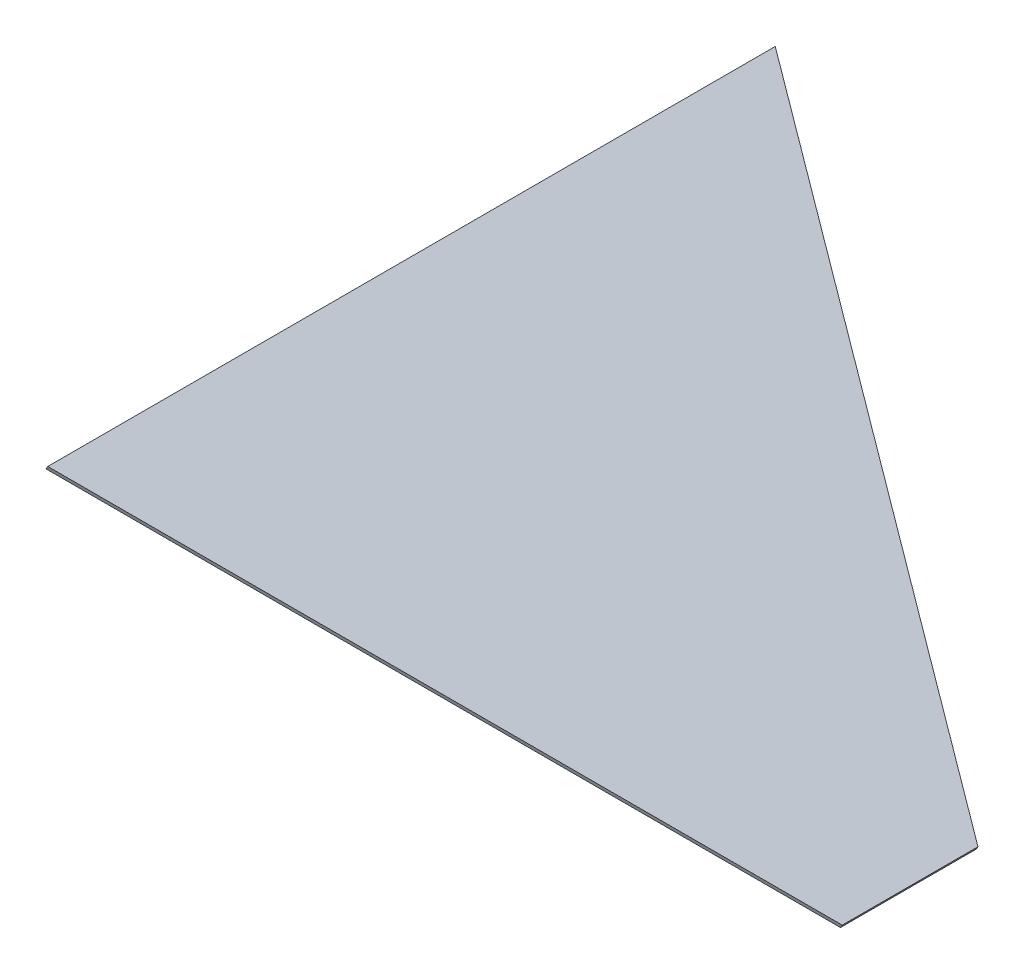
ISO-10303-21;
HEADER;
FILE_DESCRIPTION(('STEP AP214'),'2;1');
FILE_NAME('part.step','',(''),(''),'','','');
FILE_SCHEMA(('AUTOMOTIVE_DESIGN { 1 0 10303 214 1 1 1 1 }'));
ENDSEC;
DATA;
#1=APPLICATION_CONTEXT('core data for automotive mechanical design processes');
#2=APPLICATION_PROTOCOL_DEFINITION('international standard','automotive_design',2000,#1);
#3=PRODUCT_CONTEXT('',#1,'mechanical');
#4=PRODUCT('Part','Part','',(#3));
#5=PRODUCT_RELATED_PRODUCT_CATEGORY('part','',(#4));
#6=PRODUCT_DEFINITION_FORMATION('','',#4);
#7=PRODUCT_DEFINITION_CONTEXT('part definition',#1,'design');
#8=PRODUCT_DEFINITION('design','',#6,#7);
#9=PRODUCT_DEFINITION_SHAPE('','',#8);
#10=(LENGTH_UNIT() NAMED_UNIT(*) SI_UNIT(.MILLI.,.METRE.));
#11=(NAMED_UNIT(*) PLANE_ANGLE_UNIT() SI_UNIT($,.RADIAN.));
#12=(NAMED_UNIT(*) SI_UNIT($,.STERADIAN.) SOLID_ANGLE_UNIT());
#13=UNCERTAINTY_MEASURE_WITH_UNIT(LENGTH_MEASURE(1.E-05),#10,'distance_accuracy_value','');
#14=(GEOMETRIC_REPRESENTATION_CONTEXT(3) GLOBAL_UNCERTAINTY_ASSIGNED_CONTEXT((#13)) GLOBAL_UNIT_ASSIGNED_CONTEXT((#10,
#11,#12)) REPRESENTATION_CONTEXT('',''));
#15=CARTESIAN_POINT('',(0.,0.,0.));
#16=DIRECTION('',(0.,0.,1.));
#17=DIRECTION('',(1.,0.,0.));
#18=AXIS2_PLACEMENT_3D('',#15,#16,#17);
#19=CARTESIAN_POINT('',(-341.500177396334,433.935350711786,209.));
#20=DIRECTION('',(-0.860012120645908,0.510273605374733,0.));
#21=DIRECTION('',(-0.510273605374733,-0.860012120645908,0.));
#22=AXIS2_PLACEMENT_3D('',#19,#20,#21);
#23=PLANE('',#22);
#24=DIRECTION('',(0.,0.,1.));
#25=VECTOR('',#24,1.);
#26=CARTESIAN_POINT('',(-340.479630185585,435.655374953078,209.));
#27=LINE('',#26,#25);
#28=CARTESIAN_POINT('',(-340.479630185585,435.655374953078,-209.));
#29=VERTEX_POINT('',#28);
#30=CARTESIAN_POINT('',(-340.479630185585,435.655374953078,209.));
#31=VERTEX_POINT('',#30);
#32=EDGE_CURVE('E100',#29,#31,#27,.T.);
#33=ORIENTED_EDGE('',*,*,#32,.F.);
#34=DIRECTION('',(0.510273605374733,0.860012120645908,0.));
#35=VECTOR('',#34,1.);
#36=CARTESIAN_POINT('',(-341.500177396334,433.935350711786,-209.));
#37=LINE('',#36,#35);
#38=CARTESIAN_POINT('',(-341.500177396334,433.935350711786,-209.));
#39=VERTEX_POINT('',#38);
#40=EDGE_CURVE('E11',#39,#29,#37,.T.);
#41=ORIENTED_EDGE('',*,*,#40,.F.);
#42=DIRECTION('',(0.,0.,1.));
#43=VECTOR('',#42,1.);
#44=CARTESIAN_POINT('',(-341.500177396334,433.935350711786,209.));
#45=LINE('',#44,#43);
#46=CARTESIAN_POINT('',(-341.500177396334,433.935350711786,209.));
#47=VERTEX_POINT('',#46);
#48=EDGE_CURVE('E94',#39,#47,#45,.T.);
#49=ORIENTED_EDGE('',*,*,#48,.T.);
#50=DIRECTION('',(0.510273605374733,0.860012120645908,0.));
#51=VECTOR('',#50,1.);
#52=CARTESIAN_POINT('',(-341.500177396334,433.935350711786,209.));
#53=LINE('',#52,#51);
#54=EDGE_CURVE('E39',#47,#31,#53,.T.);
#55=ORIENTED_EDGE('',*,*,#54,.T.);
#56=EDGE_LOOP('',(#33,#41,#49,#55));
#57=FACE_BOUND('',#56,.T.);
#58=ADVANCED_FACE('F36',(#57),#23,.T.);
#59=CARTESIAN_POINT('',(-55.0038193223094,263.947595828323,-39.));
#60=DIRECTION('',(0.390914600293594,-0.231942547897606,-0.890723542830247));
#61=DIRECTION('',(-0.915695015854542,0.,-0.4018739080099));
#62=AXIS2_PLACEMENT_3D('',#59,#60,#61);
#63=PLANE('',#62);
#64=DIRECTION('',(-0.766033042978676,0.454512713592145,-0.454545454545455));
#65=VECTOR('',#64,1.);
#66=CARTESIAN_POINT('',(-53.98327211156,265.667620069615,-39.));
#67=LINE('',#66,#65);
#68=CARTESIAN_POINT('',(-53.98327211156,265.667620069615,-39.));
#69=VERTEX_POINT('',#68);
#70=EDGE_CURVE('E96',#69,#29,#67,.T.);
#71=ORIENTED_EDGE('',*,*,#70,.F.);
#72=DIRECTION('',(0.510273605374733,0.860012120645908,0.));
#73=VECTOR('',#72,1.);
#74=CARTESIAN_POINT('',(-55.0038193223094,263.947595828323,-39.));
#75=LINE('',#74,#73);
#76=CARTESIAN_POINT('',(-55.0038193223094,263.947595828323,-39.));
#77=VERTEX_POINT('',#76);
#78=EDGE_CURVE('E45',#77,#69,#75,.T.);
#79=ORIENTED_EDGE('',*,*,#78,.F.);
#80=DIRECTION('',(-0.766033042978676,0.454512713592145,-0.454545454545455));
#81=VECTOR('',#80,1.);
#82=CARTESIAN_POINT('',(-55.0038193223094,263.947595828323,-39.));
#83=LINE('',#82,#81);
#84=EDGE_CURVE('E91',#77,#39,#83,.T.);
#85=ORIENTED_EDGE('',*,*,#84,.T.);
#86=ORIENTED_EDGE('',*,*,#40,.T.);
#87=EDGE_LOOP('',(#71,#79,#85,#86));
#88=FACE_BOUND('',#87,.T.);
#89=ADVANCED_FACE('F110',(#88),#63,.T.);
#90=CARTESIAN_POINT('',(-55.0038193223094,263.947595828323,39.));
#91=DIRECTION('',(0.860012120645908,-0.510273605374733,0.));
#92=DIRECTION('',(0.510273605374733,0.860012120645908,0.));
#93=AXIS2_PLACEMENT_3D('',#90,#91,#92);
#94=PLANE('',#93);
#95=DIRECTION('',(0.,0.,-1.));
#96=VECTOR('',#95,1.);
#97=CARTESIAN_POINT('',(-53.98327211156,265.667620069615,39.));
#98=LINE('',#97,#96);
#99=CARTESIAN_POINT('',(-53.98327211156,265.667620069615,39.));
#100=VERTEX_POINT('',#99);
#101=EDGE_CURVE('E86',#100,#69,#98,.T.);
#102=ORIENTED_EDGE('',*,*,#101,.F.);
#103=DIRECTION('',(0.510273605374733,0.860012120645908,0.));
#104=VECTOR('',#103,1.);
#105=CARTESIAN_POINT('',(-55.0038193223094,263.947595828323,39.));
#106=LINE('',#105,#104);
#107=CARTESIAN_POINT('',(-55.0038193223094,263.947595828323,39.));
#108=VERTEX_POINT('',#107);
#109=EDGE_CURVE('E81',#108,#100,#106,.T.);
#110=ORIENTED_EDGE('',*,*,#109,.F.);
#111=DIRECTION('',(0.,0.,-1.));
#112=VECTOR('',#111,1.);
#113=CARTESIAN_POINT('',(-55.0038193223094,263.947595828323,39.));
#114=LINE('',#113,#112);
#115=EDGE_CURVE('E84',#108,#77,#114,.T.);
#116=ORIENTED_EDGE('',*,*,#115,.T.);
#117=ORIENTED_EDGE('',*,*,#78,.T.);
#118=EDGE_LOOP('',(#102,#110,#116,#117));
#119=FACE_BOUND('',#118,.T.);
#120=ADVANCED_FACE('F83',(#119),#94,.T.);
#121=CARTESIAN_POINT('',(-341.500177396334,433.935350711786,209.));
#122=DIRECTION('',(0.390914600293594,-0.231942547897606,0.890723542830247));
#123=DIRECTION('',(0.915695015854542,0.,-0.4018739080099));
#124=AXIS2_PLACEMENT_3D('',#121,#122,#123);
#125=PLANE('',#124);
#126=DIRECTION('',(0.766033042978676,-0.454512713592145,-0.454545454545455));
#127=VECTOR('',#126,1.);
#128=CARTESIAN_POINT('',(-340.479630185585,435.655374953078,209.));
#129=LINE('',#128,#127);
#130=EDGE_CURVE('E103',#31,#100,#129,.T.);
#131=ORIENTED_EDGE('',*,*,#130,.F.);
#132=ORIENTED_EDGE('',*,*,#54,.F.);
#133=DIRECTION('',(0.766033042978676,-0.454512713592145,-0.454545454545455));
#134=VECTOR('',#133,1.);
#135=CARTESIAN_POINT('',(-341.500177396334,433.935350711786,209.));
#136=LINE('',#135,#134);
#137=EDGE_CURVE('E90',#47,#108,#136,.T.);
#138=ORIENTED_EDGE('',*,*,#137,.T.);
#139=ORIENTED_EDGE('',*,*,#109,.T.);
#140=EDGE_LOOP('',(#131,#132,#138,#139));
#141=FACE_BOUND('',#140,.T.);
#142=ADVANCED_FACE('F93',(#141),#125,.T.);
#143=CARTESIAN_POINT('',(101.509307188275,171.083186785988,0.));
#144=DIRECTION('',(0.510273605374733,0.860012120645908,0.));
#145=DIRECTION('',(-0.860012120645908,0.510273605374733,0.));
#146=AXIS2_PLACEMENT_3D('',#143,#144,#145);
#147=PLANE('',#146);
#148=ORIENTED_EDGE('',*,*,#48,.F.);
#149=ORIENTED_EDGE('',*,*,#84,.F.);
#150=ORIENTED_EDGE('',*,*,#115,.F.);
#151=ORIENTED_EDGE('',*,*,#137,.F.);
#152=EDGE_LOOP('',(#148,#149,#150,#151));
#153=FACE_BOUND('',#152,.T.);
#154=ADVANCED_FACE('F89',(#153),#147,.F.);
#155=CARTESIAN_POINT('',(102.529854399024,172.80321102728,0.));
#156=DIRECTION('',(0.510273605374733,0.860012120645908,0.));
#157=DIRECTION('',(-0.860012120645908,0.510273605374733,0.));
#158=AXIS2_PLACEMENT_3D('',#155,#156,#157);
#159=PLANE('',#158);
#160=ORIENTED_EDGE('',*,*,#32,.T.);
#161=ORIENTED_EDGE('',*,*,#130,.T.);
#162=ORIENTED_EDGE('',*,*,#101,.T.);
#163=ORIENTED_EDGE('',*,*,#70,.T.);
#164=EDGE_LOOP('',(#160,#161,#162,#163));
#165=FACE_BOUND('',#164,.T.);
#166=ADVANCED_FACE('F109',(#165),#159,.T.);
#167=CLOSED_SHELL('',(#58,#89,#120,#142,#154,#166));
#168=MANIFOLD_SOLID_BREP('B2',#167);
#169=ADVANCED_BREP_SHAPE_REPRESENTATION('',(#18,#168),#14);
#170=SHAPE_DEFINITION_REPRESENTATION(#9,#169);
ENDSEC;
END-ISO-10303-21;
